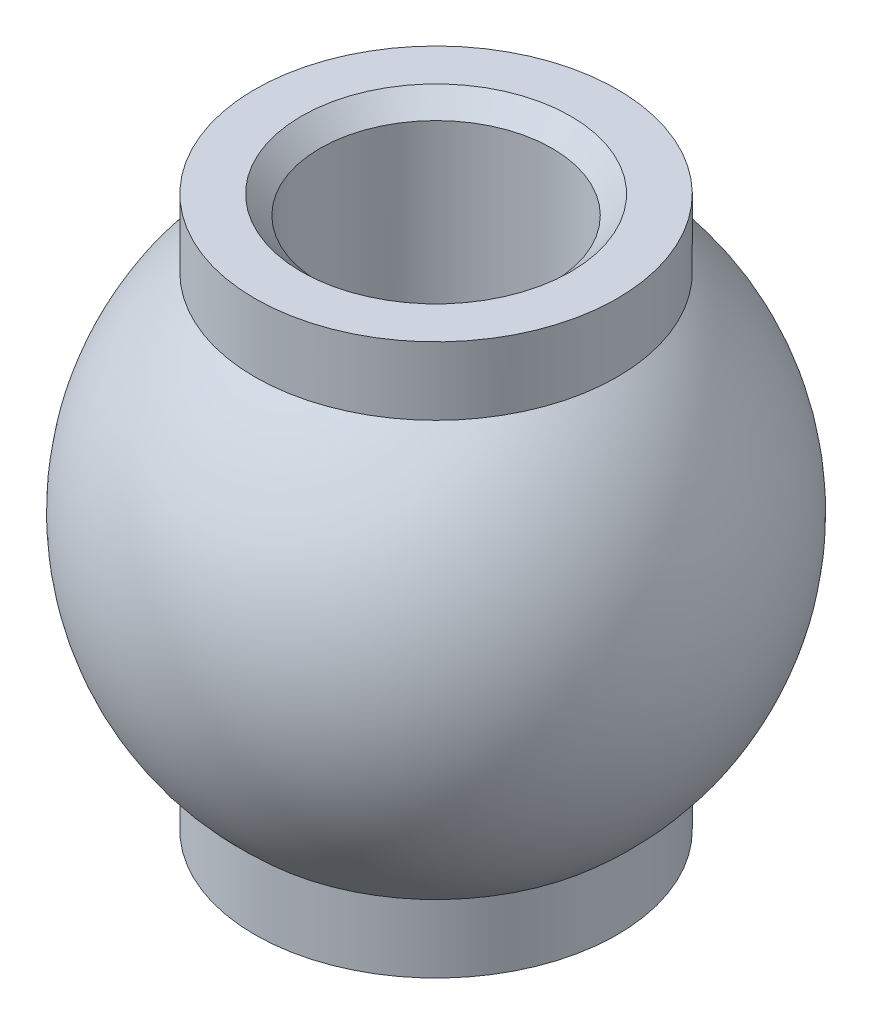
ISO-10303-21;
HEADER;
FILE_DESCRIPTION(('STEP AP214'),'2;1');
FILE_NAME('part.step','',(''),(''),'','','');
FILE_SCHEMA(('AUTOMOTIVE_DESIGN { 1 0 10303 214 1 1 1 1 }'));
ENDSEC;
DATA;
#1=APPLICATION_CONTEXT('core data for automotive mechanical design processes');
#2=APPLICATION_PROTOCOL_DEFINITION('international standard','automotive_design',2000,#1);
#3=PRODUCT_CONTEXT('',#1,'mechanical');
#4=PRODUCT('Part','Part','',(#3));
#5=PRODUCT_RELATED_PRODUCT_CATEGORY('part','',(#4));
#6=PRODUCT_DEFINITION_FORMATION('','',#4);
#7=PRODUCT_DEFINITION_CONTEXT('part definition',#1,'design');
#8=PRODUCT_DEFINITION('design','',#6,#7);
#9=PRODUCT_DEFINITION_SHAPE('','',#8);
#10=(LENGTH_UNIT() NAMED_UNIT(*) SI_UNIT(.MILLI.,.METRE.));
#11=(NAMED_UNIT(*) PLANE_ANGLE_UNIT() SI_UNIT($,.RADIAN.));
#12=(NAMED_UNIT(*) SI_UNIT($,.STERADIAN.) SOLID_ANGLE_UNIT());
#13=UNCERTAINTY_MEASURE_WITH_UNIT(LENGTH_MEASURE(1.E-05),#10,'distance_accuracy_value','');
#14=(GEOMETRIC_REPRESENTATION_CONTEXT(3) GLOBAL_UNCERTAINTY_ASSIGNED_CONTEXT((#13)) GLOBAL_UNIT_ASSIGNED_CONTEXT((#10,
#11,#12)) REPRESENTATION_CONTEXT('',''));
#15=CARTESIAN_POINT('',(0.,0.,0.));
#16=DIRECTION('',(0.,0.,1.));
#17=DIRECTION('',(1.,0.,0.));
#18=AXIS2_PLACEMENT_3D('',#15,#16,#17);
#19=CARTESIAN_POINT('',(0.,0.,0.));
#20=DIRECTION('',(0.,1.,0.));
#21=DIRECTION('',(0.,0.,1.));
#22=AXIS2_PLACEMENT_3D('',#19,#20,#21);
#23=CYLINDRICAL_SURFACE('',#22,3.175);
#24=CARTESIAN_POINT('',(0.,7.02310000002626,0.));
#25=DIRECTION('',(0.,1.,0.));
#26=DIRECTION('',(0.,0.,-1.));
#27=AXIS2_PLACEMENT_3D('',#24,#25,#26);
#28=CIRCLE('',#27,3.17499999999882);
#29=CARTESIAN_POINT('',(0.,7.02310000002626,-3.17499999999882));
#30=VERTEX_POINT('',#29);
#31=EDGE_CURVE('E48',#30,#30,#28,.T.);
#32=ORIENTED_EDGE('',*,*,#31,.T.);
#33=EDGE_LOOP('',(#32));
#34=FACE_BOUND('',#33,.T.);
#35=CARTESIAN_POINT('',(0.,-7.02310000002626,0.));
#36=DIRECTION('',(0.,-1.,0.));
#37=DIRECTION('',(0.,0.,-1.));
#38=AXIS2_PLACEMENT_3D('',#35,#36,#37);
#39=CIRCLE('',#38,3.17499999999882);
#40=CARTESIAN_POINT('',(0.,-7.02310000002626,-3.17499999999882));
#41=VERTEX_POINT('',#40);
#42=EDGE_CURVE('E51',#41,#41,#39,.T.);
#43=ORIENTED_EDGE('',*,*,#42,.T.);
#44=EDGE_LOOP('',(#43));
#45=FACE_BOUND('',#44,.T.);
#46=ADVANCED_FACE('F15',(#34,#45),#23,.F.);
#47=CARTESIAN_POINT('',(0.,-7.53110000010793,0.));
#48=DIRECTION('',(0.,-1.,0.));
#49=DIRECTION('',(0.,0.,-1.));
#50=AXIS2_PLACEMENT_3D('',#47,#48,#49);
#51=CONICAL_SURFACE('',#50,3.68300000008048,0.785398163397448);
#52=CARTESIAN_POINT('',(0.,-7.53110000005108,0.));
#53=DIRECTION('',(0.,-1.,0.));
#54=DIRECTION('',(0.,0.,-1.));
#55=AXIS2_PLACEMENT_3D('',#52,#53,#54);
#56=CIRCLE('',#55,3.68300000002364);
#57=CARTESIAN_POINT('',(0.,-7.53110000005108,-3.68300000002364));
#58=VERTEX_POINT('',#57);
#59=EDGE_CURVE('E18',#58,#58,#56,.F.);
#60=ORIENTED_EDGE('',*,*,#59,.F.);
#61=EDGE_LOOP('',(#60));
#62=FACE_BOUND('',#61,.T.);
#63=ORIENTED_EDGE('',*,*,#42,.F.);
#64=EDGE_LOOP('',(#63));
#65=FACE_BOUND('',#64,.T.);
#66=ADVANCED_FACE('F69',(#62,#65),#51,.F.);
#67=CARTESIAN_POINT('',(0.,7.53110000010793,0.));
#68=DIRECTION('',(0.,1.,0.));
#69=DIRECTION('',(-1.,0.,0.));
#70=AXIS2_PLACEMENT_3D('',#67,#68,#69);
#71=CONICAL_SURFACE('',#70,3.68300000008048,0.785398163397448);
#72=CARTESIAN_POINT('',(0.,7.53110000005108,0.));
#73=DIRECTION('',(0.,1.,0.));
#74=DIRECTION('',(-1.,0.,0.));
#75=AXIS2_PLACEMENT_3D('',#72,#73,#74);
#76=CIRCLE('',#75,3.68300000002364);
#77=CARTESIAN_POINT('',(-3.68300000002364,7.53110000005108,0.));
#78=VERTEX_POINT('',#77);
#79=EDGE_CURVE('E60',#78,#78,#76,.F.);
#80=ORIENTED_EDGE('',*,*,#79,.F.);
#81=EDGE_LOOP('',(#80));
#82=FACE_BOUND('',#81,.T.);
#83=ORIENTED_EDGE('',*,*,#31,.F.);
#84=EDGE_LOOP('',(#83));
#85=FACE_BOUND('',#84,.T.);
#86=ADVANCED_FACE('F72',(#82,#85),#71,.F.);
#87=CARTESIAN_POINT('',(0.,-7.5311,0.));
#88=DIRECTION('',(0.,-1.,0.));
#89=DIRECTION('',(0.,0.,-1.));
#90=AXIS2_PLACEMENT_3D('',#87,#88,#89);
#91=PLANE('',#90);
#92=CARTESIAN_POINT('',(0.,-7.5311,0.));
#93=DIRECTION('',(0.,1.,0.));
#94=DIRECTION('',(0.,0.,1.));
#95=AXIS2_PLACEMENT_3D('',#92,#93,#94);
#96=CIRCLE('',#95,4.953);
#97=CARTESIAN_POINT('',(0.,-7.5311,4.953));
#98=VERTEX_POINT('',#97);
#99=EDGE_CURVE('E58',#98,#98,#96,.T.);
#100=ORIENTED_EDGE('',*,*,#99,.F.);
#101=EDGE_LOOP('',(#100));
#102=FACE_BOUND('',#101,.T.);
#103=ORIENTED_EDGE('',*,*,#59,.T.);
#104=EDGE_LOOP('',(#103));
#105=FACE_BOUND('',#104,.T.);
#106=ADVANCED_FACE('F67',(#102,#105),#91,.T.);
#107=CARTESIAN_POINT('',(0.,7.5311,0.));
#108=DIRECTION('',(0.,1.,0.));
#109=DIRECTION('',(0.,0.,1.));
#110=AXIS2_PLACEMENT_3D('',#107,#108,#109);
#111=PLANE('',#110);
#112=CARTESIAN_POINT('',(0.,7.5311,0.));
#113=DIRECTION('',(0.,1.,0.));
#114=DIRECTION('',(0.,0.,1.));
#115=AXIS2_PLACEMENT_3D('',#112,#113,#114);
#116=CIRCLE('',#115,4.953);
#117=CARTESIAN_POINT('',(0.,7.5311,4.953));
#118=VERTEX_POINT('',#117);
#119=EDGE_CURVE('E55',#118,#118,#116,.F.);
#120=ORIENTED_EDGE('',*,*,#119,.F.);
#121=EDGE_LOOP('',(#120));
#122=FACE_BOUND('',#121,.T.);
#123=ORIENTED_EDGE('',*,*,#79,.T.);
#124=EDGE_LOOP('',(#123));
#125=FACE_BOUND('',#124,.T.);
#126=ADVANCED_FACE('F87',(#122,#125),#111,.T.);
#127=CARTESIAN_POINT('',(0.,0.,0.));
#128=DIRECTION('',(0.,1.,0.));
#129=DIRECTION('',(0.,0.,1.));
#130=AXIS2_PLACEMENT_3D('',#127,#128,#129);
#131=CYLINDRICAL_SURFACE('',#130,4.953);
#132=ORIENTED_EDGE('',*,*,#99,.T.);
#133=EDGE_LOOP('',(#132));
#134=FACE_BOUND('',#133,.T.);
#135=CARTESIAN_POINT('',(0.,-5.6732052853744,0.));
#136=DIRECTION('',(0.,1.,0.));
#137=DIRECTION('',(0.,0.,1.));
#138=AXIS2_PLACEMENT_3D('',#135,#136,#137);
#139=CIRCLE('',#138,4.953);
#140=CARTESIAN_POINT('',(0.,-5.6732052853744,4.953));
#141=VERTEX_POINT('',#140);
#142=EDGE_CURVE('E24',#141,#141,#139,.T.);
#143=ORIENTED_EDGE('',*,*,#142,.F.);
#144=EDGE_LOOP('',(#143));
#145=FACE_BOUND('',#144,.T.);
#146=ADVANCED_FACE('F39',(#134,#145),#131,.T.);
#147=CARTESIAN_POINT('',(0.,0.,0.));
#148=DIRECTION('',(0.,1.,0.));
#149=DIRECTION('',(0.,0.,1.));
#150=AXIS2_PLACEMENT_3D('',#147,#148,#149);
#151=CYLINDRICAL_SURFACE('',#150,4.953);
#152=CARTESIAN_POINT('',(0.,5.6732052853744,0.));
#153=DIRECTION('',(0.,1.,0.));
#154=DIRECTION('',(0.,0.,1.));
#155=AXIS2_PLACEMENT_3D('',#152,#153,#154);
#156=CIRCLE('',#155,4.953);
#157=CARTESIAN_POINT('',(0.,5.6732052853744,4.953));
#158=VERTEX_POINT('',#157);
#159=EDGE_CURVE('E10',#158,#158,#156,.F.);
#160=ORIENTED_EDGE('',*,*,#159,.F.);
#161=EDGE_LOOP('',(#160));
#162=FACE_BOUND('',#161,.T.);
#163=ORIENTED_EDGE('',*,*,#119,.T.);
#164=EDGE_LOOP('',(#163));
#165=FACE_BOUND('',#164,.T.);
#166=ADVANCED_FACE('F32',(#162,#165),#151,.T.);
#167=CARTESIAN_POINT('',(0.,0.,0.));
#168=DIRECTION('',(1.,0.,0.));
#169=DIRECTION('',(0.,1.,0.));
#170=AXIS2_PLACEMENT_3D('',#167,#168,#169);
#171=SPHERICAL_SURFACE('',#170,7.5311);
#172=ORIENTED_EDGE('',*,*,#142,.T.);
#173=EDGE_LOOP('',(#172));
#174=FACE_BOUND('',#173,.T.);
#175=ORIENTED_EDGE('',*,*,#159,.T.);
#176=EDGE_LOOP('',(#175));
#177=FACE_BOUND('',#176,.T.);
#178=CARTESIAN_POINT('',(-7.5311,0.,0.));
#179=VERTEX_POINT('',#178);
#180=VERTEX_LOOP('',#179);
#181=FACE_BOUND('',#180,.T.);
#182=CARTESIAN_POINT('',(7.5311,0.,0.));
#183=VERTEX_POINT('',#182);
#184=VERTEX_LOOP('',#183);
#185=FACE_BOUND('',#184,.T.);
#186=ADVANCED_FACE('F30',(#174,#177,#181,#185),#171,.T.);
#187=CLOSED_SHELL('',(#46,#66,#86,#106,#126,#146,#166,#186));
#188=MANIFOLD_SOLID_BREP('B1',#187);
#189=ADVANCED_BREP_SHAPE_REPRESENTATION('',(#18,#188),#14);
#190=SHAPE_DEFINITION_REPRESENTATION(#9,#189);
ENDSEC;
END-ISO-10303-21;
